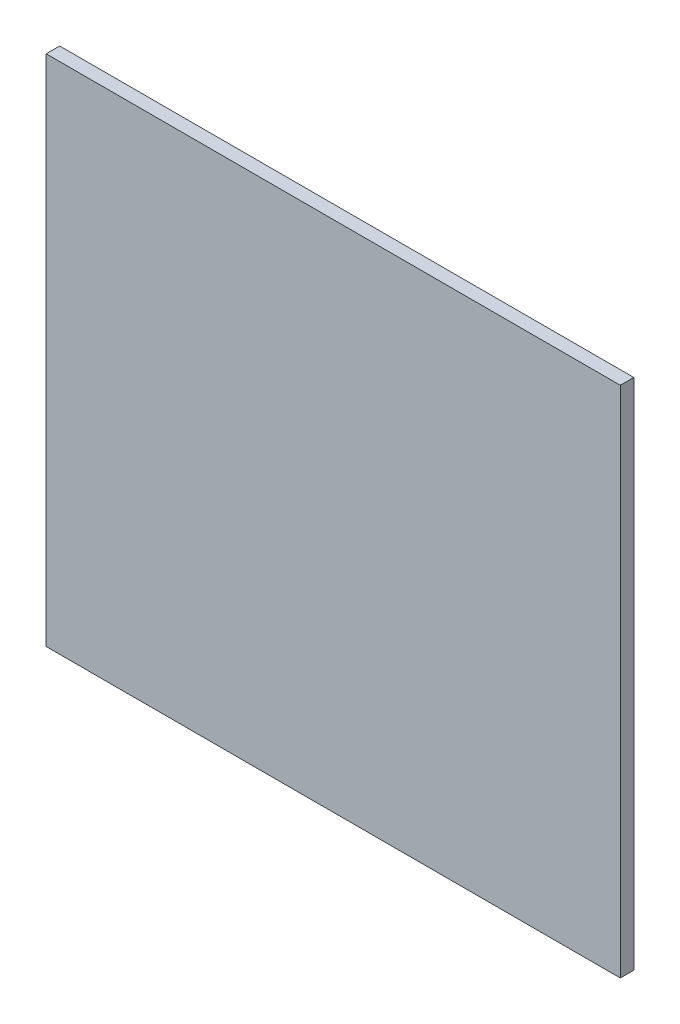
ISO-10303-21;
HEADER;
FILE_DESCRIPTION(('STEP AP214'),'2;1');
FILE_NAME('part.step','',(''),(''),'','','');
FILE_SCHEMA(('AUTOMOTIVE_DESIGN { 1 0 10303 214 1 1 1 1 }'));
ENDSEC;
DATA;
#1=APPLICATION_CONTEXT('core data for automotive mechanical design processes');
#2=APPLICATION_PROTOCOL_DEFINITION('international standard','automotive_design',2000,#1);
#3=PRODUCT_CONTEXT('',#1,'mechanical');
#4=PRODUCT('Part','Part','',(#3));
#5=PRODUCT_RELATED_PRODUCT_CATEGORY('part','',(#4));
#6=PRODUCT_DEFINITION_FORMATION('','',#4);
#7=PRODUCT_DEFINITION_CONTEXT('part definition',#1,'design');
#8=PRODUCT_DEFINITION('design','',#6,#7);
#9=PRODUCT_DEFINITION_SHAPE('','',#8);
#10=(LENGTH_UNIT() NAMED_UNIT(*) SI_UNIT(.MILLI.,.METRE.));
#11=(NAMED_UNIT(*) PLANE_ANGLE_UNIT() SI_UNIT($,.RADIAN.));
#12=(NAMED_UNIT(*) SI_UNIT($,.STERADIAN.) SOLID_ANGLE_UNIT());
#13=UNCERTAINTY_MEASURE_WITH_UNIT(LENGTH_MEASURE(1.E-05),#10,'distance_accuracy_value','');
#14=(GEOMETRIC_REPRESENTATION_CONTEXT(3) GLOBAL_UNCERTAINTY_ASSIGNED_CONTEXT((#13)) GLOBAL_UNIT_ASSIGNED_CONTEXT((#10,
#11,#12)) REPRESENTATION_CONTEXT('',''));
#15=CARTESIAN_POINT('',(0.,0.,0.));
#16=DIRECTION('',(0.,0.,1.));
#17=DIRECTION('',(1.,0.,0.));
#18=AXIS2_PLACEMENT_3D('',#15,#16,#17);
#19=CARTESIAN_POINT('',(212.5,190.,10.));
#20=DIRECTION('',(-1.,0.,0.));
#21=DIRECTION('',(0.,-1.,0.));
#22=AXIS2_PLACEMENT_3D('',#19,#20,#21);
#23=PLANE('',#22);
#24=DIRECTION('',(0.,1.,0.));
#25=VECTOR('',#24,1.);
#26=CARTESIAN_POINT('',(212.5,190.,0.));
#27=LINE('',#26,#25);
#28=CARTESIAN_POINT('',(212.5,-190.,0.));
#29=VERTEX_POINT('',#28);
#30=CARTESIAN_POINT('',(212.5,190.,0.));
#31=VERTEX_POINT('',#30);
#32=EDGE_CURVE('E98',#29,#31,#27,.T.);
#33=ORIENTED_EDGE('',*,*,#32,.T.);
#34=DIRECTION('',(0.,0.,-1.));
#35=VECTOR('',#34,1.);
#36=CARTESIAN_POINT('',(212.5,190.,10.));
#37=LINE('',#36,#35);
#38=CARTESIAN_POINT('',(212.5,190.,10.));
#39=VERTEX_POINT('',#38);
#40=EDGE_CURVE('E11',#39,#31,#37,.T.);
#41=ORIENTED_EDGE('',*,*,#40,.F.);
#42=DIRECTION('',(0.,1.,0.));
#43=VECTOR('',#42,1.);
#44=CARTESIAN_POINT('',(212.5,190.,10.));
#45=LINE('',#44,#43);
#46=CARTESIAN_POINT('',(212.5,-190.,10.));
#47=VERTEX_POINT('',#46);
#48=EDGE_CURVE('E86',#47,#39,#45,.T.);
#49=ORIENTED_EDGE('',*,*,#48,.F.);
#50=DIRECTION('',(0.,0.,-1.));
#51=VECTOR('',#50,1.);
#52=CARTESIAN_POINT('',(212.5,-190.,10.));
#53=LINE('',#52,#51);
#54=EDGE_CURVE('E94',#47,#29,#53,.T.);
#55=ORIENTED_EDGE('',*,*,#54,.T.);
#56=EDGE_LOOP('',(#33,#41,#49,#55));
#57=FACE_BOUND('',#56,.T.);
#58=ADVANCED_FACE('F35',(#57),#23,.F.);
#59=CARTESIAN_POINT('',(-212.5,190.,10.));
#60=DIRECTION('',(0.,-1.,0.));
#61=DIRECTION('',(0.,0.,-1.));
#62=AXIS2_PLACEMENT_3D('',#59,#60,#61);
#63=PLANE('',#62);
#64=DIRECTION('',(-1.,0.,0.));
#65=VECTOR('',#64,1.);
#66=CARTESIAN_POINT('',(-212.5,190.,0.));
#67=LINE('',#66,#65);
#68=CARTESIAN_POINT('',(-212.5,190.,0.));
#69=VERTEX_POINT('',#68);
#70=EDGE_CURVE('E90',#31,#69,#67,.T.);
#71=ORIENTED_EDGE('',*,*,#70,.T.);
#72=DIRECTION('',(0.,0.,-1.));
#73=VECTOR('',#72,1.);
#74=CARTESIAN_POINT('',(-212.5,190.,10.));
#75=LINE('',#74,#73);
#76=CARTESIAN_POINT('',(-212.5,190.,10.));
#77=VERTEX_POINT('',#76);
#78=EDGE_CURVE('E43',#77,#69,#75,.T.);
#79=ORIENTED_EDGE('',*,*,#78,.F.);
#80=DIRECTION('',(-1.,0.,0.));
#81=VECTOR('',#80,1.);
#82=CARTESIAN_POINT('',(-212.5,190.,10.));
#83=LINE('',#82,#81);
#84=EDGE_CURVE('E81',#39,#77,#83,.T.);
#85=ORIENTED_EDGE('',*,*,#84,.F.);
#86=ORIENTED_EDGE('',*,*,#40,.T.);
#87=EDGE_LOOP('',(#71,#79,#85,#86));
#88=FACE_BOUND('',#87,.T.);
#89=ADVANCED_FACE('F89',(#88),#63,.F.);
#90=CARTESIAN_POINT('',(-212.5,190.,10.));
#91=DIRECTION('',(1.,0.,0.));
#92=DIRECTION('',(0.,1.,0.));
#93=AXIS2_PLACEMENT_3D('',#90,#91,#92);
#94=PLANE('',#93);
#95=DIRECTION('',(0.,-1.,0.));
#96=VECTOR('',#95,1.);
#97=CARTESIAN_POINT('',(-212.5,190.,0.));
#98=LINE('',#97,#96);
#99=CARTESIAN_POINT('',(-212.5,-190.,0.));
#100=VERTEX_POINT('',#99);
#101=EDGE_CURVE('E68',#69,#100,#98,.T.);
#102=ORIENTED_EDGE('',*,*,#101,.T.);
#103=DIRECTION('',(0.,0.,-1.));
#104=VECTOR('',#103,1.);
#105=CARTESIAN_POINT('',(-212.5,-190.,10.));
#106=LINE('',#105,#104);
#107=CARTESIAN_POINT('',(-212.5,-190.,10.));
#108=VERTEX_POINT('',#107);
#109=EDGE_CURVE('E91',#108,#100,#106,.T.);
#110=ORIENTED_EDGE('',*,*,#109,.F.);
#111=DIRECTION('',(0.,-1.,0.));
#112=VECTOR('',#111,1.);
#113=CARTESIAN_POINT('',(-212.5,190.,10.));
#114=LINE('',#113,#112);
#115=EDGE_CURVE('E84',#77,#108,#114,.T.);
#116=ORIENTED_EDGE('',*,*,#115,.F.);
#117=ORIENTED_EDGE('',*,*,#78,.T.);
#118=EDGE_LOOP('',(#102,#110,#116,#117));
#119=FACE_BOUND('',#118,.T.);
#120=ADVANCED_FACE('F92',(#119),#94,.F.);
#121=CARTESIAN_POINT('',(-212.5,-190.,10.));
#122=DIRECTION('',(0.,1.,0.));
#123=DIRECTION('',(0.,0.,1.));
#124=AXIS2_PLACEMENT_3D('',#121,#122,#123);
#125=PLANE('',#124);
#126=DIRECTION('',(1.,0.,0.));
#127=VECTOR('',#126,1.);
#128=CARTESIAN_POINT('',(-212.5,-190.,0.));
#129=LINE('',#128,#127);
#130=EDGE_CURVE('E74',#100,#29,#129,.T.);
#131=ORIENTED_EDGE('',*,*,#130,.T.);
#132=ORIENTED_EDGE('',*,*,#54,.F.);
#133=DIRECTION('',(1.,0.,0.));
#134=VECTOR('',#133,1.);
#135=CARTESIAN_POINT('',(-212.5,-190.,10.));
#136=LINE('',#135,#134);
#137=EDGE_CURVE('E51',#108,#47,#136,.T.);
#138=ORIENTED_EDGE('',*,*,#137,.F.);
#139=ORIENTED_EDGE('',*,*,#109,.T.);
#140=EDGE_LOOP('',(#131,#132,#138,#139));
#141=FACE_BOUND('',#140,.T.);
#142=ADVANCED_FACE('F105',(#141),#125,.F.);
#143=CARTESIAN_POINT('',(0.,0.,10.));
#144=DIRECTION('',(0.,0.,1.));
#145=DIRECTION('',(1.,0.,0.));
#146=AXIS2_PLACEMENT_3D('',#143,#144,#145);
#147=PLANE('',#146);
#148=ORIENTED_EDGE('',*,*,#48,.T.);
#149=ORIENTED_EDGE('',*,*,#84,.T.);
#150=ORIENTED_EDGE('',*,*,#115,.T.);
#151=ORIENTED_EDGE('',*,*,#137,.T.);
#152=EDGE_LOOP('',(#148,#149,#150,#151));
#153=FACE_BOUND('',#152,.T.);
#154=ADVANCED_FACE('F82',(#153),#147,.T.);
#155=CARTESIAN_POINT('',(0.,0.,0.));
#156=DIRECTION('',(0.,0.,1.));
#157=DIRECTION('',(1.,0.,0.));
#158=AXIS2_PLACEMENT_3D('',#155,#156,#157);
#159=PLANE('',#158);
#160=ORIENTED_EDGE('',*,*,#32,.F.);
#161=ORIENTED_EDGE('',*,*,#130,.F.);
#162=ORIENTED_EDGE('',*,*,#101,.F.);
#163=ORIENTED_EDGE('',*,*,#70,.F.);
#164=EDGE_LOOP('',(#160,#161,#162,#163));
#165=FACE_BOUND('',#164,.T.);
#166=ADVANCED_FACE('F108',(#165),#159,.F.);
#167=CLOSED_SHELL('',(#58,#89,#120,#142,#154,#166));
#168=MANIFOLD_SOLID_BREP('B2',#167);
#169=ADVANCED_BREP_SHAPE_REPRESENTATION('',(#18,#168),#14);
#170=SHAPE_DEFINITION_REPRESENTATION(#9,#169);
ENDSEC;
END-ISO-10303-21;
